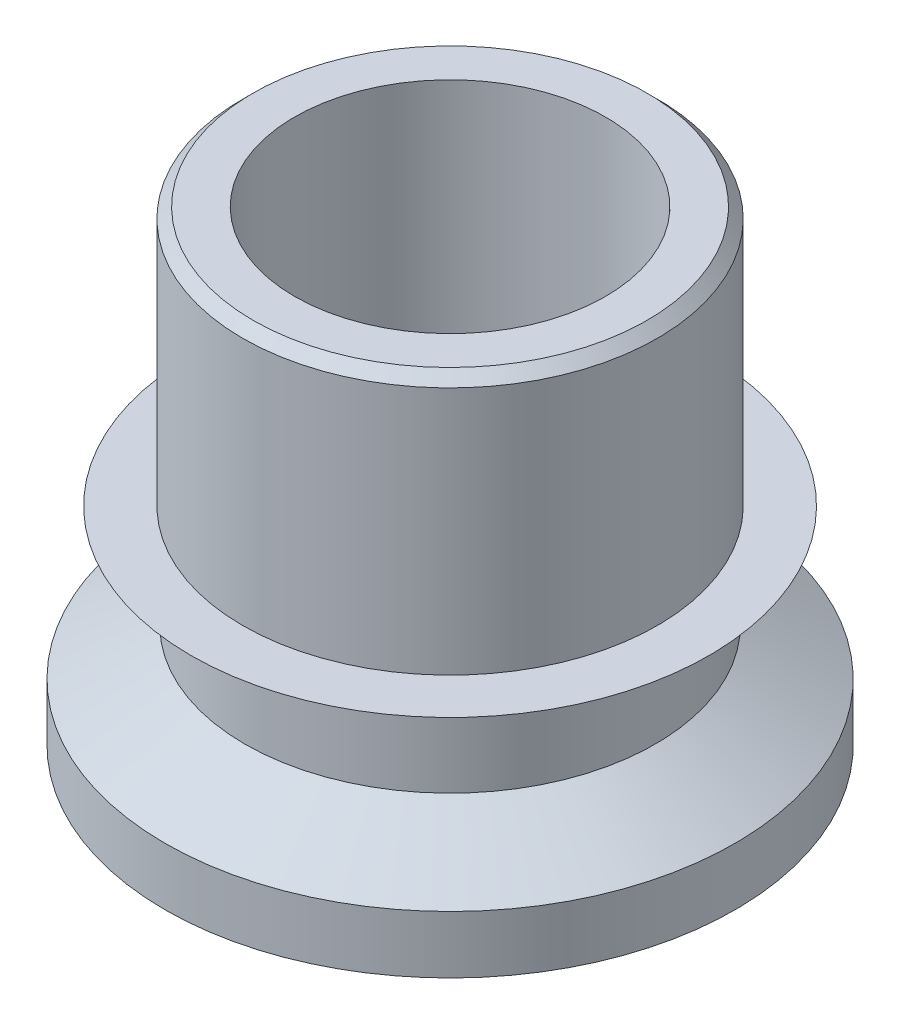
ISO-10303-21;
HEADER;
FILE_DESCRIPTION(('STEP AP214'),'2;1');
FILE_NAME('part.step','',(''),(''),'','','');
FILE_SCHEMA(('AUTOMOTIVE_DESIGN { 1 0 10303 214 1 1 1 1 }'));
ENDSEC;
DATA;
#1=APPLICATION_CONTEXT('core data for automotive mechanical design processes');
#2=APPLICATION_PROTOCOL_DEFINITION('international standard','automotive_design',2000,#1);
#3=PRODUCT_CONTEXT('',#1,'mechanical');
#4=PRODUCT('Part','Part','',(#3));
#5=PRODUCT_RELATED_PRODUCT_CATEGORY('part','',(#4));
#6=PRODUCT_DEFINITION_FORMATION('','',#4);
#7=PRODUCT_DEFINITION_CONTEXT('part definition',#1,'design');
#8=PRODUCT_DEFINITION('design','',#6,#7);
#9=PRODUCT_DEFINITION_SHAPE('','',#8);
#10=(LENGTH_UNIT() NAMED_UNIT(*) SI_UNIT(.MILLI.,.METRE.));
#11=(NAMED_UNIT(*) PLANE_ANGLE_UNIT() SI_UNIT($,.RADIAN.));
#12=(NAMED_UNIT(*) SI_UNIT($,.STERADIAN.) SOLID_ANGLE_UNIT());
#13=UNCERTAINTY_MEASURE_WITH_UNIT(LENGTH_MEASURE(1.E-05),#10,'distance_accuracy_value','');
#14=(GEOMETRIC_REPRESENTATION_CONTEXT(3) GLOBAL_UNCERTAINTY_ASSIGNED_CONTEXT((#13)) GLOBAL_UNIT_ASSIGNED_CONTEXT((#10,
#11,#12)) REPRESENTATION_CONTEXT('',''));
#15=CARTESIAN_POINT('',(0.,0.,0.));
#16=DIRECTION('',(0.,0.,1.));
#17=DIRECTION('',(1.,0.,0.));
#18=AXIS2_PLACEMENT_3D('',#15,#16,#17);
#19=CARTESIAN_POINT('',(0.,0.,0.));
#20=DIRECTION('',(0.,1.,0.));
#21=DIRECTION('',(0.,0.,1.));
#22=AXIS2_PLACEMENT_3D('',#19,#20,#21);
#23=CYLINDRICAL_SURFACE('',#22,3.);
#24=CARTESIAN_POINT('',(0.,7.,0.));
#25=DIRECTION('',(0.,1.,0.));
#26=DIRECTION('',(0.,0.,1.));
#27=AXIS2_PLACEMENT_3D('',#24,#25,#26);
#28=CIRCLE('',#27,3.);
#29=CARTESIAN_POINT('',(0.,7.,3.));
#30=VERTEX_POINT('',#29);
#31=EDGE_CURVE('E10',#30,#30,#28,.T.);
#32=ORIENTED_EDGE('',*,*,#31,.T.);
#33=EDGE_LOOP('',(#32));
#34=FACE_BOUND('',#33,.T.);
#35=CARTESIAN_POINT('',(0.,-2.,0.));
#36=DIRECTION('',(0.,1.,0.));
#37=DIRECTION('',(0.,0.,1.));
#38=AXIS2_PLACEMENT_3D('',#35,#36,#37);
#39=CIRCLE('',#38,3.);
#40=CARTESIAN_POINT('',(0.,-2.,3.));
#41=VERTEX_POINT('',#40);
#42=EDGE_CURVE('E73',#41,#41,#39,.T.);
#43=ORIENTED_EDGE('',*,*,#42,.F.);
#44=EDGE_LOOP('',(#43));
#45=FACE_BOUND('',#44,.T.);
#46=ADVANCED_FACE('F39',(#34,#45),#23,.F.);
#47=CARTESIAN_POINT('',(-3.,7.,0.));
#48=DIRECTION('',(0.,1.,0.));
#49=DIRECTION('',(0.,0.,1.));
#50=AXIS2_PLACEMENT_3D('',#47,#48,#49);
#51=PLANE('',#50);
#52=CARTESIAN_POINT('',(0.,7.,0.));
#53=DIRECTION('',(0.,1.,0.));
#54=DIRECTION('',(0.,0.,1.));
#55=AXIS2_PLACEMENT_3D('',#52,#53,#54);
#56=CIRCLE('',#55,3.8);
#57=CARTESIAN_POINT('',(0.,7.,3.8));
#58=VERTEX_POINT('',#57);
#59=EDGE_CURVE('E45',#58,#58,#56,.T.);
#60=ORIENTED_EDGE('',*,*,#59,.T.);
#61=EDGE_LOOP('',(#60));
#62=FACE_BOUND('',#61,.T.);
#63=ORIENTED_EDGE('',*,*,#31,.F.);
#64=EDGE_LOOP('',(#63));
#65=FACE_BOUND('',#64,.T.);
#66=ADVANCED_FACE('F81',(#62,#65),#51,.T.);
#67=CARTESIAN_POINT('',(0.,7.,0.));
#68=DIRECTION('',(0.,-1.,0.));
#69=DIRECTION('',(0.,0.,-1.));
#70=AXIS2_PLACEMENT_3D('',#67,#68,#69);
#71=CONICAL_SURFACE('',#70,3.8,0.785398163397449);
#72=CARTESIAN_POINT('',(0.,6.8,0.));
#73=DIRECTION('',(0.,1.,0.));
#74=DIRECTION('',(0.,0.,1.));
#75=AXIS2_PLACEMENT_3D('',#72,#73,#74);
#76=CIRCLE('',#75,4.);
#77=CARTESIAN_POINT('',(0.,6.8,4.));
#78=VERTEX_POINT('',#77);
#79=EDGE_CURVE('E49',#78,#78,#76,.T.);
#80=ORIENTED_EDGE('',*,*,#79,.T.);
#81=EDGE_LOOP('',(#80));
#82=FACE_BOUND('',#81,.T.);
#83=ORIENTED_EDGE('',*,*,#59,.F.);
#84=EDGE_LOOP('',(#83));
#85=FACE_BOUND('',#84,.T.);
#86=ADVANCED_FACE('F85',(#82,#85),#71,.T.);
#87=CARTESIAN_POINT('',(0.,0.,0.));
#88=DIRECTION('',(0.,1.,0.));
#89=DIRECTION('',(0.,0.,1.));
#90=AXIS2_PLACEMENT_3D('',#87,#88,#89);
#91=CYLINDRICAL_SURFACE('',#90,4.);
#92=CARTESIAN_POINT('',(0.,2.,0.));
#93=DIRECTION('',(0.,1.,0.));
#94=DIRECTION('',(0.,0.,1.));
#95=AXIS2_PLACEMENT_3D('',#92,#93,#94);
#96=CIRCLE('',#95,4.);
#97=CARTESIAN_POINT('',(0.,2.,4.));
#98=VERTEX_POINT('',#97);
#99=EDGE_CURVE('E53',#98,#98,#96,.T.);
#100=ORIENTED_EDGE('',*,*,#99,.T.);
#101=EDGE_LOOP('',(#100));
#102=FACE_BOUND('',#101,.T.);
#103=ORIENTED_EDGE('',*,*,#79,.F.);
#104=EDGE_LOOP('',(#103));
#105=FACE_BOUND('',#104,.T.);
#106=ADVANCED_FACE('F89',(#102,#105),#91,.T.);
#107=CARTESIAN_POINT('',(-4.,2.00000000000001,0.));
#108=DIRECTION('',(0.,1.,0.));
#109=DIRECTION('',(0.,0.,1.));
#110=AXIS2_PLACEMENT_3D('',#107,#108,#109);
#111=PLANE('',#110);
#112=CARTESIAN_POINT('',(0.,2.00000000000001,0.));
#113=DIRECTION('',(0.,1.,0.));
#114=DIRECTION('',(0.,0.,1.));
#115=AXIS2_PLACEMENT_3D('',#112,#113,#114);
#116=CIRCLE('',#115,5.00000000000001);
#117=CARTESIAN_POINT('',(0.,2.00000000000001,5.00000000000001));
#118=VERTEX_POINT('',#117);
#119=EDGE_CURVE('E58',#118,#118,#116,.T.);
#120=ORIENTED_EDGE('',*,*,#119,.T.);
#121=EDGE_LOOP('',(#120));
#122=FACE_BOUND('',#121,.T.);
#123=ORIENTED_EDGE('',*,*,#99,.F.);
#124=EDGE_LOOP('',(#123));
#125=FACE_BOUND('',#124,.T.);
#126=ADVANCED_FACE('F96',(#122,#125),#111,.T.);
#127=CARTESIAN_POINT('',(0.,2.00000000000001,0.));
#128=DIRECTION('',(0.,1.,0.));
#129=DIRECTION('',(0.,0.,1.));
#130=AXIS2_PLACEMENT_3D('',#127,#128,#129);
#131=CONICAL_SURFACE('',#130,5.00000000000001,1.0471975511966);
#132=CARTESIAN_POINT('',(0.,1.40000000000001,0.));
#133=DIRECTION('',(0.,1.,0.));
#134=DIRECTION('',(0.,0.,1.));
#135=AXIS2_PLACEMENT_3D('',#132,#133,#134);
#136=CIRCLE('',#135,3.96076951545866);
#137=CARTESIAN_POINT('',(0.,1.40000000000001,3.96076951545866));
#138=VERTEX_POINT('',#137);
#139=EDGE_CURVE('E61',#138,#138,#136,.T.);
#140=ORIENTED_EDGE('',*,*,#139,.T.);
#141=EDGE_LOOP('',(#140));
#142=FACE_BOUND('',#141,.T.);
#143=ORIENTED_EDGE('',*,*,#119,.F.);
#144=EDGE_LOOP('',(#143));
#145=FACE_BOUND('',#144,.T.);
#146=ADVANCED_FACE('F100',(#142,#145),#131,.T.);
#147=CARTESIAN_POINT('',(0.,0.,0.));
#148=DIRECTION('',(0.,1.,0.));
#149=DIRECTION('',(0.,0.,1.));
#150=AXIS2_PLACEMENT_3D('',#147,#148,#149);
#151=CYLINDRICAL_SURFACE('',#150,3.96076951545866);
#152=CARTESIAN_POINT('',(0.,0.,0.));
#153=DIRECTION('',(0.,1.,0.));
#154=DIRECTION('',(0.,0.,1.));
#155=AXIS2_PLACEMENT_3D('',#152,#153,#154);
#156=CIRCLE('',#155,3.96076951545865);
#157=CARTESIAN_POINT('',(0.,0.,3.96076951545865));
#158=VERTEX_POINT('',#157);
#159=EDGE_CURVE('E64',#158,#158,#156,.T.);
#160=ORIENTED_EDGE('',*,*,#159,.T.);
#161=EDGE_LOOP('',(#160));
#162=FACE_BOUND('',#161,.T.);
#163=ORIENTED_EDGE('',*,*,#139,.F.);
#164=EDGE_LOOP('',(#163));
#165=FACE_BOUND('',#164,.T.);
#166=ADVANCED_FACE('F104',(#162,#165),#151,.T.);
#167=CARTESIAN_POINT('',(0.,0.,0.));
#168=DIRECTION('',(0.,-1.,0.));
#169=DIRECTION('',(0.,0.,-1.));
#170=AXIS2_PLACEMENT_3D('',#167,#168,#169);
#171=CONICAL_SURFACE('',#170,3.96076951545865,1.0471975511966);
#172=CARTESIAN_POINT('',(0.,-0.888675134594811,0.));
#173=DIRECTION('',(0.,1.,0.));
#174=DIRECTION('',(0.,0.,1.));
#175=AXIS2_PLACEMENT_3D('',#172,#173,#174);
#176=CIRCLE('',#175,5.5);
#177=CARTESIAN_POINT('',(0.,-0.888675134594811,5.5));
#178=VERTEX_POINT('',#177);
#179=EDGE_CURVE('E67',#178,#178,#176,.T.);
#180=ORIENTED_EDGE('',*,*,#179,.T.);
#181=EDGE_LOOP('',(#180));
#182=FACE_BOUND('',#181,.T.);
#183=ORIENTED_EDGE('',*,*,#159,.F.);
#184=EDGE_LOOP('',(#183));
#185=FACE_BOUND('',#184,.T.);
#186=ADVANCED_FACE('F108',(#182,#185),#171,.T.);
#187=CARTESIAN_POINT('',(0.,0.,0.));
#188=DIRECTION('',(0.,1.,0.));
#189=DIRECTION('',(0.,0.,1.));
#190=AXIS2_PLACEMENT_3D('',#187,#188,#189);
#191=CYLINDRICAL_SURFACE('',#190,5.5);
#192=CARTESIAN_POINT('',(0.,-2.,0.));
#193=DIRECTION('',(0.,1.,0.));
#194=DIRECTION('',(0.,0.,1.));
#195=AXIS2_PLACEMENT_3D('',#192,#193,#194);
#196=CIRCLE('',#195,5.5);
#197=CARTESIAN_POINT('',(0.,-2.,5.5));
#198=VERTEX_POINT('',#197);
#199=EDGE_CURVE('E70',#198,#198,#196,.T.);
#200=ORIENTED_EDGE('',*,*,#199,.T.);
#201=EDGE_LOOP('',(#200));
#202=FACE_BOUND('',#201,.T.);
#203=ORIENTED_EDGE('',*,*,#179,.F.);
#204=EDGE_LOOP('',(#203));
#205=FACE_BOUND('',#204,.T.);
#206=ADVANCED_FACE('F112',(#202,#205),#191,.T.);
#207=CARTESIAN_POINT('',(-5.5,-2.,0.));
#208=DIRECTION('',(0.,-1.,0.));
#209=DIRECTION('',(0.,0.,-1.));
#210=AXIS2_PLACEMENT_3D('',#207,#208,#209);
#211=PLANE('',#210);
#212=ORIENTED_EDGE('',*,*,#42,.T.);
#213=EDGE_LOOP('',(#212));
#214=FACE_BOUND('',#213,.T.);
#215=ORIENTED_EDGE('',*,*,#199,.F.);
#216=EDGE_LOOP('',(#215));
#217=FACE_BOUND('',#216,.T.);
#218=ADVANCED_FACE('F77',(#214,#217),#211,.T.);
#219=CLOSED_SHELL('',(#46,#66,#86,#106,#126,#146,#166,#186,#206,#218));
#220=MANIFOLD_SOLID_BREP('B2',#219);
#221=ADVANCED_BREP_SHAPE_REPRESENTATION('',(#18,#220),#14);
#222=SHAPE_DEFINITION_REPRESENTATION(#9,#221);
ENDSEC;
END-ISO-10303-21;
